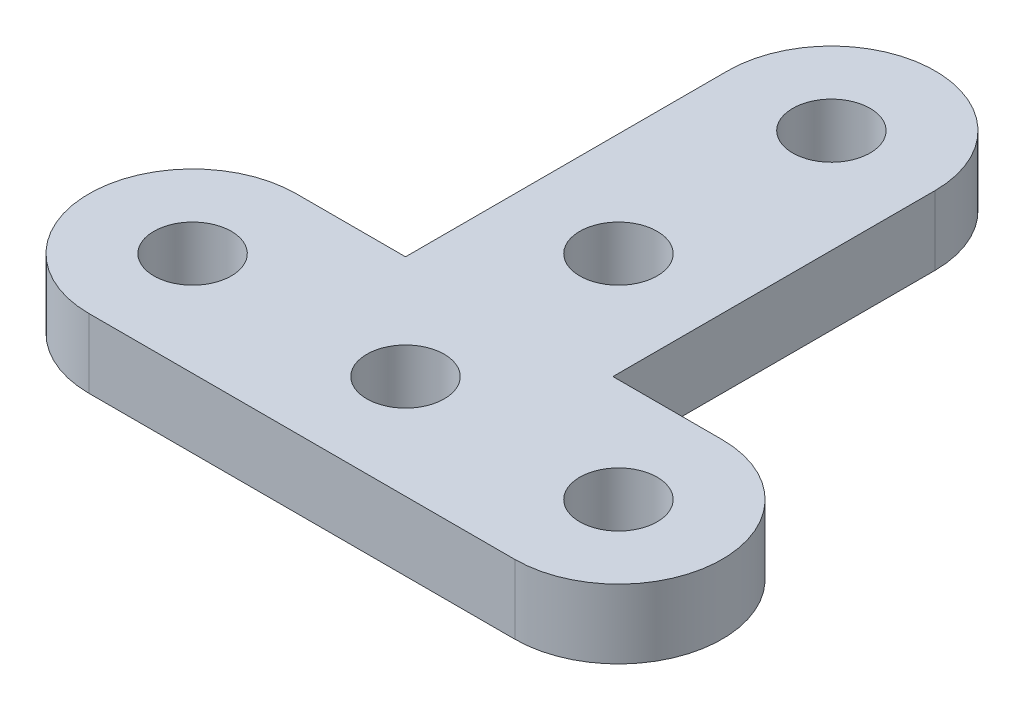
ISO-10303-21;
HEADER;
FILE_DESCRIPTION(('STEP AP214'),'2;1');
FILE_NAME('part.step','',(''),(''),'','','');
FILE_SCHEMA(('AUTOMOTIVE_DESIGN { 1 0 10303 214 1 1 1 1 }'));
ENDSEC;
DATA;
#1=APPLICATION_CONTEXT('core data for automotive mechanical design processes');
#2=APPLICATION_PROTOCOL_DEFINITION('international standard','automotive_design',2000,#1);
#3=PRODUCT_CONTEXT('',#1,'mechanical');
#4=PRODUCT('Part','Part','',(#3));
#5=PRODUCT_RELATED_PRODUCT_CATEGORY('part','',(#4));
#6=PRODUCT_DEFINITION_FORMATION('','',#4);
#7=PRODUCT_DEFINITION_CONTEXT('part definition',#1,'design');
#8=PRODUCT_DEFINITION('design','',#6,#7);
#9=PRODUCT_DEFINITION_SHAPE('','',#8);
#10=(LENGTH_UNIT() NAMED_UNIT(*) SI_UNIT(.MILLI.,.METRE.));
#11=(NAMED_UNIT(*) PLANE_ANGLE_UNIT() SI_UNIT($,.RADIAN.));
#12=(NAMED_UNIT(*) SI_UNIT($,.STERADIAN.) SOLID_ANGLE_UNIT());
#13=UNCERTAINTY_MEASURE_WITH_UNIT(LENGTH_MEASURE(1.E-05),#10,'distance_accuracy_value','');
#14=(GEOMETRIC_REPRESENTATION_CONTEXT(3) GLOBAL_UNCERTAINTY_ASSIGNED_CONTEXT((#13)) GLOBAL_UNIT_ASSIGNED_CONTEXT((#10,
#11,#12)) REPRESENTATION_CONTEXT('',''));
#15=CARTESIAN_POINT('',(0.,0.,0.));
#16=DIRECTION('',(0.,0.,1.));
#17=DIRECTION('',(1.,0.,0.));
#18=AXIS2_PLACEMENT_3D('',#15,#16,#17);
#19=CARTESIAN_POINT('',(9.779,0.,-4.7625));
#20=DIRECTION('',(0.,0.,-1.));
#21=DIRECTION('',(-1.,0.,0.));
#22=AXIS2_PLACEMENT_3D('',#19,#20,#21);
#23=PLANE('',#22);
#24=DIRECTION('',(-1.,0.,0.));
#25=VECTOR('',#24,1.);
#26=CARTESIAN_POINT('',(9.779,3.175,-4.7625));
#27=LINE('',#26,#25);
#28=CARTESIAN_POINT('',(9.779,3.175,-4.7625));
#29=VERTEX_POINT('',#28);
#30=CARTESIAN_POINT('',(4.7625,3.175,-4.7625));
#31=VERTEX_POINT('',#30);
#32=EDGE_CURVE('E129',#29,#31,#27,.T.);
#33=ORIENTED_EDGE('',*,*,#32,.F.);
#34=DIRECTION('',(0.,1.,0.));
#35=VECTOR('',#34,1.);
#36=CARTESIAN_POINT('',(9.779,0.,-4.7625));
#37=LINE('',#36,#35);
#38=CARTESIAN_POINT('',(9.779,0.,-4.7625));
#39=VERTEX_POINT('',#38);
#40=EDGE_CURVE('E11',#39,#29,#37,.T.);
#41=ORIENTED_EDGE('',*,*,#40,.F.);
#42=DIRECTION('',(-1.,0.,0.));
#43=VECTOR('',#42,1.);
#44=CARTESIAN_POINT('',(9.779,0.,-4.7625));
#45=LINE('',#44,#43);
#46=CARTESIAN_POINT('',(4.7625,0.,-4.7625));
#47=VERTEX_POINT('',#46);
#48=EDGE_CURVE('E150',#39,#47,#45,.T.);
#49=ORIENTED_EDGE('',*,*,#48,.T.);
#50=DIRECTION('',(0.,1.,0.));
#51=VECTOR('',#50,1.);
#52=CARTESIAN_POINT('',(4.7625,0.,-4.7625));
#53=LINE('',#52,#51);
#54=EDGE_CURVE('E35',#47,#31,#53,.T.);
#55=ORIENTED_EDGE('',*,*,#54,.T.);
#56=EDGE_LOOP('',(#33,#41,#49,#55));
#57=FACE_BOUND('',#56,.T.);
#58=ADVANCED_FACE('F32',(#57),#23,.T.);
#59=CARTESIAN_POINT('',(9.779,0.,0.));
#60=DIRECTION('',(0.,1.,0.));
#61=DIRECTION('',(0.,0.,1.));
#62=AXIS2_PLACEMENT_3D('',#59,#60,#61);
#63=CYLINDRICAL_SURFACE('',#62,4.7625);
#64=CARTESIAN_POINT('',(9.779,3.175,0.));
#65=DIRECTION('',(0.,1.,0.));
#66=DIRECTION('',(0.,0.,1.));
#67=AXIS2_PLACEMENT_3D('',#64,#65,#66);
#68=CIRCLE('',#67,4.7625);
#69=CARTESIAN_POINT('',(9.779,3.175,4.7625));
#70=VERTEX_POINT('',#69);
#71=EDGE_CURVE('E148',#70,#29,#68,.T.);
#72=ORIENTED_EDGE('',*,*,#71,.F.);
#73=DIRECTION('',(0.,1.,0.));
#74=VECTOR('',#73,1.);
#75=CARTESIAN_POINT('',(9.779,0.,4.7625));
#76=LINE('',#75,#74);
#77=CARTESIAN_POINT('',(9.779,0.,4.7625));
#78=VERTEX_POINT('',#77);
#79=EDGE_CURVE('E41',#78,#70,#76,.T.);
#80=ORIENTED_EDGE('',*,*,#79,.F.);
#81=CARTESIAN_POINT('',(9.779,0.,0.));
#82=DIRECTION('',(0.,1.,0.));
#83=DIRECTION('',(0.,0.,1.));
#84=AXIS2_PLACEMENT_3D('',#81,#82,#83);
#85=CIRCLE('',#84,4.7625);
#86=EDGE_CURVE('E119',#78,#39,#85,.T.);
#87=ORIENTED_EDGE('',*,*,#86,.T.);
#88=ORIENTED_EDGE('',*,*,#40,.T.);
#89=EDGE_LOOP('',(#72,#80,#87,#88));
#90=FACE_BOUND('',#89,.T.);
#91=ADVANCED_FACE('F162',(#90),#63,.T.);
#92=CARTESIAN_POINT('',(-9.779,0.,4.7625));
#93=DIRECTION('',(0.,0.,1.));
#94=DIRECTION('',(1.,0.,0.));
#95=AXIS2_PLACEMENT_3D('',#92,#93,#94);
#96=PLANE('',#95);
#97=DIRECTION('',(1.,0.,0.));
#98=VECTOR('',#97,1.);
#99=CARTESIAN_POINT('',(-9.779,3.175,4.7625));
#100=LINE('',#99,#98);
#101=CARTESIAN_POINT('',(-9.779,3.175,4.7625));
#102=VERTEX_POINT('',#101);
#103=EDGE_CURVE('E106',#102,#70,#100,.T.);
#104=ORIENTED_EDGE('',*,*,#103,.F.);
#105=DIRECTION('',(0.,1.,0.));
#106=VECTOR('',#105,1.);
#107=CARTESIAN_POINT('',(-9.779,0.,4.7625));
#108=LINE('',#107,#106);
#109=CARTESIAN_POINT('',(-9.779,0.,4.7625));
#110=VERTEX_POINT('',#109);
#111=EDGE_CURVE('E101',#110,#102,#108,.T.);
#112=ORIENTED_EDGE('',*,*,#111,.F.);
#113=DIRECTION('',(1.,0.,0.));
#114=VECTOR('',#113,1.);
#115=CARTESIAN_POINT('',(-9.779,0.,4.7625));
#116=LINE('',#115,#114);
#117=EDGE_CURVE('E104',#110,#78,#116,.T.);
#118=ORIENTED_EDGE('',*,*,#117,.T.);
#119=ORIENTED_EDGE('',*,*,#79,.T.);
#120=EDGE_LOOP('',(#104,#112,#118,#119));
#121=FACE_BOUND('',#120,.T.);
#122=ADVANCED_FACE('F103',(#121),#96,.T.);
#123=CARTESIAN_POINT('',(-9.779,0.,0.));
#124=DIRECTION('',(0.,1.,0.));
#125=DIRECTION('',(0.,0.,1.));
#126=AXIS2_PLACEMENT_3D('',#123,#124,#125);
#127=CYLINDRICAL_SURFACE('',#126,4.7625);
#128=CARTESIAN_POINT('',(-9.779,3.175,0.));
#129=DIRECTION('',(0.,1.,0.));
#130=DIRECTION('',(0.,0.,1.));
#131=AXIS2_PLACEMENT_3D('',#128,#129,#130);
#132=CIRCLE('',#131,4.7625);
#133=CARTESIAN_POINT('',(-9.779,3.175,-4.7625));
#134=VERTEX_POINT('',#133);
#135=EDGE_CURVE('E145',#134,#102,#132,.T.);
#136=ORIENTED_EDGE('',*,*,#135,.F.);
#137=DIRECTION('',(0.,1.,0.));
#138=VECTOR('',#137,1.);
#139=CARTESIAN_POINT('',(-9.779,0.,-4.7625));
#140=LINE('',#139,#138);
#141=CARTESIAN_POINT('',(-9.779,0.,-4.7625));
#142=VERTEX_POINT('',#141);
#143=EDGE_CURVE('E111',#142,#134,#140,.T.);
#144=ORIENTED_EDGE('',*,*,#143,.F.);
#145=CARTESIAN_POINT('',(-9.779,0.,0.));
#146=DIRECTION('',(0.,1.,0.));
#147=DIRECTION('',(0.,0.,1.));
#148=AXIS2_PLACEMENT_3D('',#145,#146,#147);
#149=CIRCLE('',#148,4.7625);
#150=EDGE_CURVE('E117',#142,#110,#149,.T.);
#151=ORIENTED_EDGE('',*,*,#150,.T.);
#152=ORIENTED_EDGE('',*,*,#111,.T.);
#153=EDGE_LOOP('',(#136,#144,#151,#152));
#154=FACE_BOUND('',#153,.T.);
#155=ADVANCED_FACE('F121',(#154),#127,.T.);
#156=CARTESIAN_POINT('',(-4.7625,0.,-4.7625));
#157=DIRECTION('',(0.,0.,-1.));
#158=DIRECTION('',(-1.,0.,0.));
#159=AXIS2_PLACEMENT_3D('',#156,#157,#158);
#160=PLANE('',#159);
#161=DIRECTION('',(-1.,0.,0.));
#162=VECTOR('',#161,1.);
#163=CARTESIAN_POINT('',(-4.7625,3.175,-4.7625));
#164=LINE('',#163,#162);
#165=CARTESIAN_POINT('',(-4.7625,3.175,-4.7625));
#166=VERTEX_POINT('',#165);
#167=EDGE_CURVE('E142',#166,#134,#164,.T.);
#168=ORIENTED_EDGE('',*,*,#167,.F.);
#169=DIRECTION('',(0.,1.,0.));
#170=VECTOR('',#169,1.);
#171=CARTESIAN_POINT('',(-4.7625,0.,-4.7625));
#172=LINE('',#171,#170);
#173=CARTESIAN_POINT('',(-4.7625,0.,-4.7625));
#174=VERTEX_POINT('',#173);
#175=EDGE_CURVE('E154',#174,#166,#172,.T.);
#176=ORIENTED_EDGE('',*,*,#175,.F.);
#177=DIRECTION('',(-1.,0.,0.));
#178=VECTOR('',#177,1.);
#179=CARTESIAN_POINT('',(-4.7625,0.,-4.7625));
#180=LINE('',#179,#178);
#181=EDGE_CURVE('E122',#174,#142,#180,.T.);
#182=ORIENTED_EDGE('',*,*,#181,.T.);
#183=ORIENTED_EDGE('',*,*,#143,.T.);
#184=EDGE_LOOP('',(#168,#176,#182,#183));
#185=FACE_BOUND('',#184,.T.);
#186=ADVANCED_FACE('F175',(#185),#160,.T.);
#187=CARTESIAN_POINT('',(-4.7625,0.,-19.558));
#188=DIRECTION('',(-1.,0.,0.));
#189=DIRECTION('',(0.,0.,1.));
#190=AXIS2_PLACEMENT_3D('',#187,#188,#189);
#191=PLANE('',#190);
#192=DIRECTION('',(0.,0.,1.));
#193=VECTOR('',#192,1.);
#194=CARTESIAN_POINT('',(-4.7625,3.175,-19.558));
#195=LINE('',#194,#193);
#196=CARTESIAN_POINT('',(-4.7625,3.175,-19.558));
#197=VERTEX_POINT('',#196);
#198=EDGE_CURVE('E139',#197,#166,#195,.T.);
#199=ORIENTED_EDGE('',*,*,#198,.F.);
#200=DIRECTION('',(0.,1.,0.));
#201=VECTOR('',#200,1.);
#202=CARTESIAN_POINT('',(-4.7625,0.,-19.558));
#203=LINE('',#202,#201);
#204=CARTESIAN_POINT('',(-4.7625,0.,-19.558));
#205=VERTEX_POINT('',#204);
#206=EDGE_CURVE('E156',#205,#197,#203,.T.);
#207=ORIENTED_EDGE('',*,*,#206,.F.);
#208=DIRECTION('',(0.,0.,1.));
#209=VECTOR('',#208,1.);
#210=CARTESIAN_POINT('',(-4.7625,0.,-19.558));
#211=LINE('',#210,#209);
#212=EDGE_CURVE('E124',#205,#174,#211,.T.);
#213=ORIENTED_EDGE('',*,*,#212,.T.);
#214=ORIENTED_EDGE('',*,*,#175,.T.);
#215=EDGE_LOOP('',(#199,#207,#213,#214));
#216=FACE_BOUND('',#215,.T.);
#217=ADVANCED_FACE('F178',(#216),#191,.T.);
#218=CARTESIAN_POINT('',(0.,0.,-19.558));
#219=DIRECTION('',(0.,1.,0.));
#220=DIRECTION('',(0.,0.,1.));
#221=AXIS2_PLACEMENT_3D('',#218,#219,#220);
#222=CYLINDRICAL_SURFACE('',#221,4.7625);
#223=CARTESIAN_POINT('',(0.,3.175,-19.558));
#224=DIRECTION('',(0.,1.,0.));
#225=DIRECTION('',(0.,0.,1.));
#226=AXIS2_PLACEMENT_3D('',#223,#224,#225);
#227=CIRCLE('',#226,4.7625);
#228=CARTESIAN_POINT('',(4.7625,3.175,-19.558));
#229=VERTEX_POINT('',#228);
#230=EDGE_CURVE('E136',#229,#197,#227,.T.);
#231=ORIENTED_EDGE('',*,*,#230,.F.);
#232=DIRECTION('',(0.,1.,0.));
#233=VECTOR('',#232,1.);
#234=CARTESIAN_POINT('',(4.7625,0.,-19.558));
#235=LINE('',#234,#233);
#236=CARTESIAN_POINT('',(4.7625,0.,-19.558));
#237=VERTEX_POINT('',#236);
#238=EDGE_CURVE('E157',#237,#229,#235,.T.);
#239=ORIENTED_EDGE('',*,*,#238,.F.);
#240=CARTESIAN_POINT('',(0.,0.,-19.558));
#241=DIRECTION('',(0.,1.,0.));
#242=DIRECTION('',(0.,0.,1.));
#243=AXIS2_PLACEMENT_3D('',#240,#241,#242);
#244=CIRCLE('',#243,4.7625);
#245=EDGE_CURVE('E254',#237,#205,#244,.T.);
#246=ORIENTED_EDGE('',*,*,#245,.T.);
#247=ORIENTED_EDGE('',*,*,#206,.T.);
#248=EDGE_LOOP('',(#231,#239,#246,#247));
#249=FACE_BOUND('',#248,.T.);
#250=ADVANCED_FACE('F182',(#249),#222,.T.);
#251=CARTESIAN_POINT('',(4.7625,0.,-4.7625));
#252=DIRECTION('',(1.,0.,0.));
#253=DIRECTION('',(0.,0.,-1.));
#254=AXIS2_PLACEMENT_3D('',#251,#252,#253);
#255=PLANE('',#254);
#256=DIRECTION('',(0.,0.,-1.));
#257=VECTOR('',#256,1.);
#258=CARTESIAN_POINT('',(4.7625,3.175,-4.7625));
#259=LINE('',#258,#257);
#260=EDGE_CURVE('E132',#31,#229,#259,.T.);
#261=ORIENTED_EDGE('',*,*,#260,.F.);
#262=ORIENTED_EDGE('',*,*,#54,.F.);
#263=DIRECTION('',(0.,0.,-1.));
#264=VECTOR('',#263,1.);
#265=CARTESIAN_POINT('',(4.7625,0.,-4.7625));
#266=LINE('',#265,#264);
#267=EDGE_CURVE('E252',#47,#237,#266,.T.);
#268=ORIENTED_EDGE('',*,*,#267,.T.);
#269=ORIENTED_EDGE('',*,*,#238,.T.);
#270=EDGE_LOOP('',(#261,#262,#268,#269));
#271=FACE_BOUND('',#270,.T.);
#272=ADVANCED_FACE('F159',(#271),#255,.T.);
#273=CARTESIAN_POINT('',(0.,0.,-19.558));
#274=DIRECTION('',(0.,1.,0.));
#275=DIRECTION('',(0.,0.,1.));
#276=AXIS2_PLACEMENT_3D('',#273,#274,#275);
#277=PLANE('',#276);
#278=CARTESIAN_POINT('',(0.,0.,0.));
#279=DIRECTION('',(0.,1.,0.));
#280=DIRECTION('',(0.,0.,-1.));
#281=AXIS2_PLACEMENT_3D('',#278,#279,#280);
#282=CIRCLE('',#281,1.77799999999999);
#283=CARTESIAN_POINT('',(0.,0.,-1.77799999999999));
#284=VERTEX_POINT('',#283);
#285=EDGE_CURVE('E221',#284,#284,#282,.T.);
#286=ORIENTED_EDGE('',*,*,#285,.T.);
#287=EDGE_LOOP('',(#286));
#288=FACE_BOUND('',#287,.T.);
#289=CARTESIAN_POINT('',(-9.779,0.,0.));
#290=DIRECTION('',(0.,1.,0.));
#291=DIRECTION('',(0.,0.,-1.));
#292=AXIS2_PLACEMENT_3D('',#289,#290,#291);
#293=CIRCLE('',#292,1.77799999999999);
#294=CARTESIAN_POINT('',(-9.779,0.,-1.77799999999999));
#295=VERTEX_POINT('',#294);
#296=EDGE_CURVE('E229',#295,#295,#293,.T.);
#297=ORIENTED_EDGE('',*,*,#296,.T.);
#298=EDGE_LOOP('',(#297));
#299=FACE_BOUND('',#298,.T.);
#300=CARTESIAN_POINT('',(0.,0.,-9.77899999999998));
#301=DIRECTION('',(0.,1.,0.));
#302=DIRECTION('',(0.,0.,-1.));
#303=AXIS2_PLACEMENT_3D('',#300,#301,#302);
#304=CIRCLE('',#303,1.77799999999999);
#305=CARTESIAN_POINT('',(0.,0.,-11.557));
#306=VERTEX_POINT('',#305);
#307=EDGE_CURVE('E235',#306,#306,#304,.T.);
#308=ORIENTED_EDGE('',*,*,#307,.T.);
#309=EDGE_LOOP('',(#308));
#310=FACE_BOUND('',#309,.T.);
#311=CARTESIAN_POINT('',(9.779,0.,0.));
#312=DIRECTION('',(0.,1.,0.));
#313=DIRECTION('',(0.,0.,-1.));
#314=AXIS2_PLACEMENT_3D('',#311,#312,#313);
#315=CIRCLE('',#314,1.77799999999999);
#316=CARTESIAN_POINT('',(9.779,0.,-1.77799999999999));
#317=VERTEX_POINT('',#316);
#318=EDGE_CURVE('E241',#317,#317,#315,.T.);
#319=ORIENTED_EDGE('',*,*,#318,.T.);
#320=EDGE_LOOP('',(#319));
#321=FACE_BOUND('',#320,.T.);
#322=CARTESIAN_POINT('',(0.,0.,-19.558));
#323=DIRECTION('',(0.,1.,0.));
#324=DIRECTION('',(0.,0.,-1.));
#325=AXIS2_PLACEMENT_3D('',#322,#323,#324);
#326=CIRCLE('',#325,1.77799999999999);
#327=CARTESIAN_POINT('',(0.,0.,-21.336));
#328=VERTEX_POINT('',#327);
#329=EDGE_CURVE('E133',#328,#328,#326,.T.);
#330=ORIENTED_EDGE('',*,*,#329,.T.);
#331=EDGE_LOOP('',(#330));
#332=FACE_BOUND('',#331,.T.);
#333=ORIENTED_EDGE('',*,*,#48,.F.);
#334=ORIENTED_EDGE('',*,*,#86,.F.);
#335=ORIENTED_EDGE('',*,*,#117,.F.);
#336=ORIENTED_EDGE('',*,*,#150,.F.);
#337=ORIENTED_EDGE('',*,*,#181,.F.);
#338=ORIENTED_EDGE('',*,*,#212,.F.);
#339=ORIENTED_EDGE('',*,*,#245,.F.);
#340=ORIENTED_EDGE('',*,*,#267,.F.);
#341=EDGE_LOOP('',(#333,#334,#335,#336,#337,#338,#339,#340));
#342=FACE_BOUND('',#341,.T.);
#343=ADVANCED_FACE('F115',(#288,#299,#310,#321,#332,#342),#277,.F.);
#344=CARTESIAN_POINT('',(0.,3.175,-19.558));
#345=DIRECTION('',(0.,1.,0.));
#346=DIRECTION('',(0.,0.,1.));
#347=AXIS2_PLACEMENT_3D('',#344,#345,#346);
#348=PLANE('',#347);
#349=CARTESIAN_POINT('',(0.,3.175,0.));
#350=DIRECTION('',(0.,1.,0.));
#351=DIRECTION('',(0.,0.,-1.));
#352=AXIS2_PLACEMENT_3D('',#349,#350,#351);
#353=CIRCLE('',#352,1.77799999999999);
#354=CARTESIAN_POINT('',(0.,3.175,-1.77799999999999));
#355=VERTEX_POINT('',#354);
#356=EDGE_CURVE('E224',#355,#355,#353,.T.);
#357=ORIENTED_EDGE('',*,*,#356,.F.);
#358=EDGE_LOOP('',(#357));
#359=FACE_BOUND('',#358,.T.);
#360=CARTESIAN_POINT('',(-9.779,3.175,0.));
#361=DIRECTION('',(0.,1.,0.));
#362=DIRECTION('',(0.,0.,-1.));
#363=AXIS2_PLACEMENT_3D('',#360,#361,#362);
#364=CIRCLE('',#363,1.77799999999999);
#365=CARTESIAN_POINT('',(-9.779,3.175,-1.77799999999999));
#366=VERTEX_POINT('',#365);
#367=EDGE_CURVE('E226',#366,#366,#364,.T.);
#368=ORIENTED_EDGE('',*,*,#367,.F.);
#369=EDGE_LOOP('',(#368));
#370=FACE_BOUND('',#369,.T.);
#371=CARTESIAN_POINT('',(0.,3.175,-9.77899999999998));
#372=DIRECTION('',(0.,1.,0.));
#373=DIRECTION('',(0.,0.,-1.));
#374=AXIS2_PLACEMENT_3D('',#371,#372,#373);
#375=CIRCLE('',#374,1.77799999999999);
#376=CARTESIAN_POINT('',(0.,3.175,-11.557));
#377=VERTEX_POINT('',#376);
#378=EDGE_CURVE('E232',#377,#377,#375,.T.);
#379=ORIENTED_EDGE('',*,*,#378,.F.);
#380=EDGE_LOOP('',(#379));
#381=FACE_BOUND('',#380,.T.);
#382=CARTESIAN_POINT('',(9.779,3.175,0.));
#383=DIRECTION('',(0.,1.,0.));
#384=DIRECTION('',(0.,0.,-1.));
#385=AXIS2_PLACEMENT_3D('',#382,#383,#384);
#386=CIRCLE('',#385,1.77799999999999);
#387=CARTESIAN_POINT('',(9.779,3.175,-1.77799999999999));
#388=VERTEX_POINT('',#387);
#389=EDGE_CURVE('E238',#388,#388,#386,.T.);
#390=ORIENTED_EDGE('',*,*,#389,.F.);
#391=EDGE_LOOP('',(#390));
#392=FACE_BOUND('',#391,.T.);
#393=CARTESIAN_POINT('',(0.,3.175,-19.558));
#394=DIRECTION('',(0.,1.,0.));
#395=DIRECTION('',(0.,0.,-1.));
#396=AXIS2_PLACEMENT_3D('',#393,#394,#395);
#397=CIRCLE('',#396,1.77799999999999);
#398=CARTESIAN_POINT('',(0.,3.175,-21.336));
#399=VERTEX_POINT('',#398);
#400=EDGE_CURVE('E244',#399,#399,#397,.T.);
#401=ORIENTED_EDGE('',*,*,#400,.F.);
#402=EDGE_LOOP('',(#401));
#403=FACE_BOUND('',#402,.T.);
#404=ORIENTED_EDGE('',*,*,#32,.T.);
#405=ORIENTED_EDGE('',*,*,#260,.T.);
#406=ORIENTED_EDGE('',*,*,#230,.T.);
#407=ORIENTED_EDGE('',*,*,#198,.T.);
#408=ORIENTED_EDGE('',*,*,#167,.T.);
#409=ORIENTED_EDGE('',*,*,#135,.T.);
#410=ORIENTED_EDGE('',*,*,#103,.T.);
#411=ORIENTED_EDGE('',*,*,#71,.T.);
#412=EDGE_LOOP('',(#404,#405,#406,#407,#408,#409,#410,#411));
#413=FACE_BOUND('',#412,.T.);
#414=ADVANCED_FACE('F161',(#359,#370,#381,#392,#403,#413),#348,.T.);
#415=CARTESIAN_POINT('',(0.,0.,-19.558));
#416=DIRECTION('',(0.,1.,0.));
#417=DIRECTION('',(0.,0.,1.));
#418=AXIS2_PLACEMENT_3D('',#415,#416,#417);
#419=CYLINDRICAL_SURFACE('',#418,1.77799999999999);
#420=ORIENTED_EDGE('',*,*,#329,.F.);
#421=EDGE_LOOP('',(#420));
#422=FACE_BOUND('',#421,.T.);
#423=ORIENTED_EDGE('',*,*,#400,.T.);
#424=EDGE_LOOP('',(#423));
#425=FACE_BOUND('',#424,.T.);
#426=ADVANCED_FACE('F194',(#422,#425),#419,.F.);
#427=CARTESIAN_POINT('',(9.779,0.,0.));
#428=DIRECTION('',(0.,1.,0.));
#429=DIRECTION('',(0.,0.,1.));
#430=AXIS2_PLACEMENT_3D('',#427,#428,#429);
#431=CYLINDRICAL_SURFACE('',#430,1.77799999999999);
#432=ORIENTED_EDGE('',*,*,#318,.F.);
#433=EDGE_LOOP('',(#432));
#434=FACE_BOUND('',#433,.T.);
#435=ORIENTED_EDGE('',*,*,#389,.T.);
#436=EDGE_LOOP('',(#435));
#437=FACE_BOUND('',#436,.T.);
#438=ADVANCED_FACE('F201',(#434,#437),#431,.F.);
#439=CARTESIAN_POINT('',(0.,0.,-9.77899999999998));
#440=DIRECTION('',(0.,1.,0.));
#441=DIRECTION('',(0.,0.,1.));
#442=AXIS2_PLACEMENT_3D('',#439,#440,#441);
#443=CYLINDRICAL_SURFACE('',#442,1.77799999999999);
#444=ORIENTED_EDGE('',*,*,#307,.F.);
#445=EDGE_LOOP('',(#444));
#446=FACE_BOUND('',#445,.T.);
#447=ORIENTED_EDGE('',*,*,#378,.T.);
#448=EDGE_LOOP('',(#447));
#449=FACE_BOUND('',#448,.T.);
#450=ADVANCED_FACE('F205',(#446,#449),#443,.F.);
#451=CARTESIAN_POINT('',(-9.779,0.,0.));
#452=DIRECTION('',(0.,1.,0.));
#453=DIRECTION('',(0.,0.,1.));
#454=AXIS2_PLACEMENT_3D('',#451,#452,#453);
#455=CYLINDRICAL_SURFACE('',#454,1.77799999999999);
#456=ORIENTED_EDGE('',*,*,#296,.F.);
#457=EDGE_LOOP('',(#456));
#458=FACE_BOUND('',#457,.T.);
#459=ORIENTED_EDGE('',*,*,#367,.T.);
#460=EDGE_LOOP('',(#459));
#461=FACE_BOUND('',#460,.T.);
#462=ADVANCED_FACE('F209',(#458,#461),#455,.F.);
#463=CARTESIAN_POINT('',(0.,0.,0.));
#464=DIRECTION('',(0.,1.,0.));
#465=DIRECTION('',(0.,0.,1.));
#466=AXIS2_PLACEMENT_3D('',#463,#464,#465);
#467=CYLINDRICAL_SURFACE('',#466,1.77799999999999);
#468=ORIENTED_EDGE('',*,*,#285,.F.);
#469=EDGE_LOOP('',(#468));
#470=FACE_BOUND('',#469,.T.);
#471=ORIENTED_EDGE('',*,*,#356,.T.);
#472=EDGE_LOOP('',(#471));
#473=FACE_BOUND('',#472,.T.);
#474=ADVANCED_FACE('F213',(#470,#473),#467,.F.);
#475=CLOSED_SHELL('',(#58,#91,#122,#155,#186,#217,#250,#272,#343,#414,#426,#438,#450,#462,#474));
#476=MANIFOLD_SOLID_BREP('B2',#475);
#477=ADVANCED_BREP_SHAPE_REPRESENTATION('',(#18,#476),#14);
#478=SHAPE_DEFINITION_REPRESENTATION(#9,#477);
ENDSEC;
END-ISO-10303-21;
